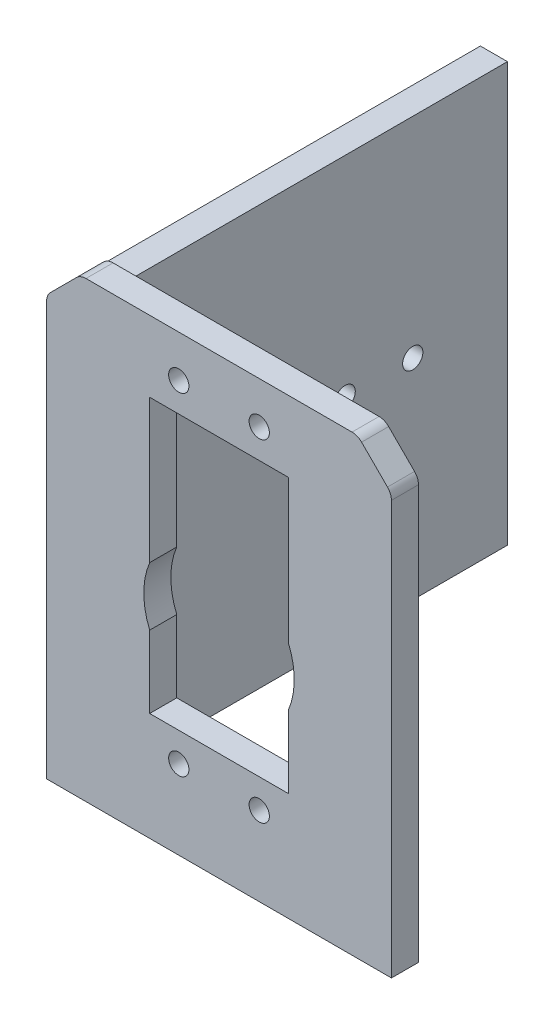
ISO-10303-21;
HEADER;
FILE_DESCRIPTION(('STEP AP214'),'2;1');
FILE_NAME('part.step','',(''),(''),'','','');
FILE_SCHEMA(('AUTOMOTIVE_DESIGN { 1 0 10303 214 1 1 1 1 }'));
ENDSEC;
DATA;
#1=APPLICATION_CONTEXT('core data for automotive mechanical design processes');
#2=APPLICATION_PROTOCOL_DEFINITION('international standard','automotive_design',2000,#1);
#3=PRODUCT_CONTEXT('',#1,'mechanical');
#4=PRODUCT('Part','Part','',(#3));
#5=PRODUCT_RELATED_PRODUCT_CATEGORY('part','',(#4));
#6=PRODUCT_DEFINITION_FORMATION('','',#4);
#7=PRODUCT_DEFINITION_CONTEXT('part definition',#1,'design');
#8=PRODUCT_DEFINITION('design','',#6,#7);
#9=PRODUCT_DEFINITION_SHAPE('','',#8);
#10=(LENGTH_UNIT() NAMED_UNIT(*) SI_UNIT(.MILLI.,.METRE.));
#11=(NAMED_UNIT(*) PLANE_ANGLE_UNIT() SI_UNIT($,.RADIAN.));
#12=(NAMED_UNIT(*) SI_UNIT($,.STERADIAN.) SOLID_ANGLE_UNIT());
#13=UNCERTAINTY_MEASURE_WITH_UNIT(LENGTH_MEASURE(1.E-05),#10,'distance_accuracy_value','');
#14=(GEOMETRIC_REPRESENTATION_CONTEXT(3) GLOBAL_UNCERTAINTY_ASSIGNED_CONTEXT((#13)) GLOBAL_UNIT_ASSIGNED_CONTEXT((#10,
#11,#12)) REPRESENTATION_CONTEXT('',''));
#15=CARTESIAN_POINT('',(0.,0.,0.));
#16=DIRECTION('',(0.,0.,1.));
#17=DIRECTION('',(1.,0.,0.));
#18=AXIS2_PLACEMENT_3D('',#15,#16,#17);
#19=CARTESIAN_POINT('',(2.,61.1715728752538,0.));
#20=DIRECTION('',(0.,0.,1.));
#21=DIRECTION('',(1.,0.,0.));
#22=AXIS2_PLACEMENT_3D('',#19,#20,#21);
#23=PLANE('',#22);
#24=DIRECTION('',(0.,1.,0.));
#25=VECTOR('',#24,1.);
#26=CARTESIAN_POINT('',(0.152240934977426,61.936939739984,0.));
#27=LINE('',#26,#25);
#28=CARTESIAN_POINT('',(0.152240934977426,0.,0.));
#29=VERTEX_POINT('',#28);
#30=CARTESIAN_POINT('',(0.152240934977428,61.936939739984,0.));
#31=VERTEX_POINT('',#30);
#32=EDGE_CURVE('E69',#29,#31,#27,.T.);
#33=ORIENTED_EDGE('',*,*,#32,.F.);
#34=DIRECTION('',(1.,0.,0.));
#35=VECTOR('',#34,1.);
#36=CARTESIAN_POINT('',(0.,0.,0.));
#37=LINE('',#36,#35);
#38=CARTESIAN_POINT('',(0.,0.,0.));
#39=VERTEX_POINT('',#38);
#40=EDGE_CURVE('E385',#39,#29,#37,.T.);
#41=ORIENTED_EDGE('',*,*,#40,.F.);
#42=DIRECTION('',(0.,-1.,0.));
#43=VECTOR('',#42,1.);
#44=CARTESIAN_POINT('',(0.,61.1715728752538,0.));
#45=LINE('',#44,#43);
#46=CARTESIAN_POINT('',(0.,61.1715728752538,0.));
#47=VERTEX_POINT('',#46);
#48=EDGE_CURVE('E382',#47,#39,#45,.T.);
#49=ORIENTED_EDGE('',*,*,#48,.F.);
#50=CARTESIAN_POINT('',(2.,61.1715728752538,0.));
#51=DIRECTION('',(0.,0.,1.));
#52=DIRECTION('',(1.,0.,0.));
#53=AXIS2_PLACEMENT_3D('',#50,#51,#52);
#54=CIRCLE('',#53,2.);
#55=EDGE_CURVE('E344',#31,#47,#54,.T.);
#56=ORIENTED_EDGE('',*,*,#55,.F.);
#57=EDGE_LOOP('',(#33,#41,#49,#56));
#58=FACE_BOUND('',#57,.T.);
#59=ADVANCED_FACE('F43',(#58),#23,.F.);
#60=CARTESIAN_POINT('',(19.55,60.8,0.));
#61=DIRECTION('',(0.,0.,1.));
#62=DIRECTION('',(1.,0.,0.));
#63=AXIS2_PLACEMENT_3D('',#60,#61,#62);
#64=CIRCLE('',#63,1.5);
#65=CARTESIAN_POINT('',(21.05,60.8,0.));
#66=VERTEX_POINT('',#65);
#67=EDGE_CURVE('E223',#66,#66,#64,.T.);
#68=ORIENTED_EDGE('',*,*,#67,.T.);
#69=EDGE_LOOP('',(#68));
#70=FACE_BOUND('',#69,.T.);
#71=CARTESIAN_POINT('',(31.45,60.8,0.));
#72=DIRECTION('',(0.,0.,1.));
#73=DIRECTION('',(1.,0.,0.));
#74=AXIS2_PLACEMENT_3D('',#71,#72,#73);
#75=CIRCLE('',#74,1.5);
#76=CARTESIAN_POINT('',(32.95,60.8,0.));
#77=VERTEX_POINT('',#76);
#78=EDGE_CURVE('E236',#77,#77,#75,.T.);
#79=ORIENTED_EDGE('',*,*,#78,.T.);
#80=EDGE_LOOP('',(#79));
#81=FACE_BOUND('',#80,.T.);
#82=CARTESIAN_POINT('',(31.4499999999995,11.7,0.));
#83=DIRECTION('',(0.,0.,1.));
#84=DIRECTION('',(1.,0.,0.));
#85=AXIS2_PLACEMENT_3D('',#82,#83,#84);
#86=CIRCLE('',#85,1.5);
#87=CARTESIAN_POINT('',(32.9499999999995,11.7,0.));
#88=VERTEX_POINT('',#87);
#89=EDGE_CURVE('E242',#88,#88,#86,.T.);
#90=ORIENTED_EDGE('',*,*,#89,.T.);
#91=EDGE_LOOP('',(#90));
#92=FACE_BOUND('',#91,.T.);
#93=CARTESIAN_POINT('',(19.5499999999995,11.7,0.));
#94=DIRECTION('',(0.,0.,1.));
#95=DIRECTION('',(1.,0.,0.));
#96=AXIS2_PLACEMENT_3D('',#93,#94,#95);
#97=CIRCLE('',#96,1.5);
#98=CARTESIAN_POINT('',(21.0499999999995,11.7,0.));
#99=VERTEX_POINT('',#98);
#100=EDGE_CURVE('E250',#99,#99,#97,.T.);
#101=ORIENTED_EDGE('',*,*,#100,.T.);
#102=EDGE_LOOP('',(#101));
#103=FACE_BOUND('',#102,.T.);
#104=DIRECTION('',(0.,-1.,0.));
#105=VECTOR('',#104,1.);
#106=CARTESIAN_POINT('',(15.25,35.3247109730015,0.));
#107=LINE('',#106,#105);
#108=CARTESIAN_POINT('',(15.25,56.5,0.));
#109=VERTEX_POINT('',#108);
#110=CARTESIAN_POINT('',(15.25,35.3247109730015,0.));
#111=VERTEX_POINT('',#110);
#112=EDGE_CURVE('E258',#109,#111,#107,.T.);
#113=ORIENTED_EDGE('',*,*,#112,.T.);
#114=CARTESIAN_POINT('',(25.5,31.,0.));
#115=DIRECTION('',(0.,0.,1.));
#116=DIRECTION('',(1.,0.,0.));
#117=AXIS2_PLACEMENT_3D('',#114,#115,#116);
#118=CIRCLE('',#117,11.125);
#119=CARTESIAN_POINT('',(15.25,26.6752890269985,0.));
#120=VERTEX_POINT('',#119);
#121=EDGE_CURVE('E292',#111,#120,#118,.T.);
#122=ORIENTED_EDGE('',*,*,#121,.T.);
#123=DIRECTION('',(0.,-1.,0.));
#124=VECTOR('',#123,1.);
#125=CARTESIAN_POINT('',(15.25,16.,0.));
#126=LINE('',#125,#124);
#127=CARTESIAN_POINT('',(15.25,16.,0.));
#128=VERTEX_POINT('',#127);
#129=EDGE_CURVE('E296',#120,#128,#126,.T.);
#130=ORIENTED_EDGE('',*,*,#129,.T.);
#131=DIRECTION('',(1.,0.,0.));
#132=VECTOR('',#131,1.);
#133=CARTESIAN_POINT('',(35.75,16.,0.));
#134=LINE('',#133,#132);
#135=CARTESIAN_POINT('',(35.75,16.,0.));
#136=VERTEX_POINT('',#135);
#137=EDGE_CURVE('E300',#128,#136,#134,.T.);
#138=ORIENTED_EDGE('',*,*,#137,.T.);
#139=DIRECTION('',(0.,1.,0.));
#140=VECTOR('',#139,1.);
#141=CARTESIAN_POINT('',(35.75,26.6752890269984,0.));
#142=LINE('',#141,#140);
#143=CARTESIAN_POINT('',(35.75,26.6752890269984,0.));
#144=VERTEX_POINT('',#143);
#145=EDGE_CURVE('E304',#136,#144,#142,.T.);
#146=ORIENTED_EDGE('',*,*,#145,.T.);
#147=CARTESIAN_POINT('',(25.5,31.,0.));
#148=DIRECTION('',(0.,0.,1.));
#149=DIRECTION('',(1.,0.,0.));
#150=AXIS2_PLACEMENT_3D('',#147,#148,#149);
#151=CIRCLE('',#150,11.125);
#152=CARTESIAN_POINT('',(35.75,35.3247109730016,0.));
#153=VERTEX_POINT('',#152);
#154=EDGE_CURVE('E308',#144,#153,#151,.T.);
#155=ORIENTED_EDGE('',*,*,#154,.T.);
#156=DIRECTION('',(0.,1.,0.));
#157=VECTOR('',#156,1.);
#158=CARTESIAN_POINT('',(35.75,56.5,0.));
#159=LINE('',#158,#157);
#160=CARTESIAN_POINT('',(35.75,56.5,0.));
#161=VERTEX_POINT('',#160);
#162=EDGE_CURVE('E312',#153,#161,#159,.T.);
#163=ORIENTED_EDGE('',*,*,#162,.T.);
#164=DIRECTION('',(-1.,0.,0.));
#165=VECTOR('',#164,1.);
#166=CARTESIAN_POINT('',(15.25,56.5,0.));
#167=LINE('',#166,#165);
#168=EDGE_CURVE('E266',#161,#109,#167,.T.);
#169=ORIENTED_EDGE('',*,*,#168,.T.);
#170=EDGE_LOOP('',(#113,#122,#130,#138,#146,#155,#163,#169));
#171=FACE_BOUND('',#170,.T.);
#172=DIRECTION('',(0.,-1.,0.));
#173=VECTOR('',#172,1.);
#174=CARTESIAN_POINT('',(4.15224093497743,61.936939739984,0.));
#175=LINE('',#174,#173);
#176=CARTESIAN_POINT('',(4.15224093497743,61.936939739984,0.));
#177=VERTEX_POINT('',#176);
#178=CARTESIAN_POINT('',(4.15224093497742,0.,0.));
#179=VERTEX_POINT('',#178);
#180=EDGE_CURVE('E219',#177,#179,#175,.T.);
#181=ORIENTED_EDGE('',*,*,#180,.F.);
#182=DIRECTION('',(1.,0.,0.));
#183=VECTOR('',#182,1.);
#184=CARTESIAN_POINT('',(0.152240934977426,61.936939739984,0.));
#185=LINE('',#184,#183);
#186=EDGE_CURVE('E466',#31,#177,#185,.T.);
#187=ORIENTED_EDGE('',*,*,#186,.F.);
#188=CARTESIAN_POINT('',(0.585786437626903,62.5857864376269,0.));
#189=VERTEX_POINT('',#188);
#190=EDGE_CURVE('E378',#189,#31,#54,.T.);
#191=ORIENTED_EDGE('',*,*,#190,.F.);
#192=DIRECTION('',(-0.707106781186546,-0.707106781186549,0.));
#193=VECTOR('',#192,1.);
#194=CARTESIAN_POINT('',(4.41421356237308,66.4142135623731,0.));
#195=LINE('',#194,#193);
#196=CARTESIAN_POINT('',(4.41421356237308,66.4142135623731,0.));
#197=VERTEX_POINT('',#196);
#198=EDGE_CURVE('E350',#197,#189,#195,.T.);
#199=ORIENTED_EDGE('',*,*,#198,.F.);
#200=CARTESIAN_POINT('',(5.82842712474618,65.,0.));
#201=DIRECTION('',(0.,0.,1.));
#202=DIRECTION('',(1.,0.,0.));
#203=AXIS2_PLACEMENT_3D('',#200,#201,#202);
#204=CIRCLE('',#203,2.);
#205=CARTESIAN_POINT('',(5.82842712474618,67.,0.));
#206=VERTEX_POINT('',#205);
#207=EDGE_CURVE('E403',#206,#197,#204,.T.);
#208=ORIENTED_EDGE('',*,*,#207,.F.);
#209=DIRECTION('',(-1.,0.,0.));
#210=VECTOR('',#209,1.);
#211=CARTESIAN_POINT('',(45.1715728752538,67.,0.));
#212=LINE('',#211,#210);
#213=CARTESIAN_POINT('',(45.1715728752538,67.,0.));
#214=VERTEX_POINT('',#213);
#215=EDGE_CURVE('E400',#214,#206,#212,.T.);
#216=ORIENTED_EDGE('',*,*,#215,.F.);
#217=CARTESIAN_POINT('',(45.1715728752538,65.,0.));
#218=DIRECTION('',(0.,0.,1.));
#219=DIRECTION('',(1.,0.,0.));
#220=AXIS2_PLACEMENT_3D('',#217,#218,#219);
#221=CIRCLE('',#220,2.);
#222=CARTESIAN_POINT('',(46.5857864376269,66.4142135623731,0.));
#223=VERTEX_POINT('',#222);
#224=EDGE_CURVE('E397',#223,#214,#221,.T.);
#225=ORIENTED_EDGE('',*,*,#224,.F.);
#226=DIRECTION('',(-0.707106781186549,0.707106781186546,0.));
#227=VECTOR('',#226,1.);
#228=CARTESIAN_POINT('',(50.4142135623731,62.5857864376269,0.));
#229=LINE('',#228,#227);
#230=CARTESIAN_POINT('',(50.4142135623731,62.5857864376269,0.));
#231=VERTEX_POINT('',#230);
#232=EDGE_CURVE('E394',#231,#223,#229,.T.);
#233=ORIENTED_EDGE('',*,*,#232,.F.);
#234=CARTESIAN_POINT('',(49.,61.1715728752538,0.));
#235=DIRECTION('',(0.,0.,1.));
#236=DIRECTION('',(1.,0.,0.));
#237=AXIS2_PLACEMENT_3D('',#234,#235,#236);
#238=CIRCLE('',#237,2.);
#239=CARTESIAN_POINT('',(51.,61.1715728752538,0.));
#240=VERTEX_POINT('',#239);
#241=EDGE_CURVE('E391',#240,#231,#238,.T.);
#242=ORIENTED_EDGE('',*,*,#241,.F.);
#243=DIRECTION('',(0.,1.,0.));
#244=VECTOR('',#243,1.);
#245=CARTESIAN_POINT('',(51.,0.,0.));
#246=LINE('',#245,#244);
#247=CARTESIAN_POINT('',(51.,0.,0.));
#248=VERTEX_POINT('',#247);
#249=EDGE_CURVE('E388',#248,#240,#246,.T.);
#250=ORIENTED_EDGE('',*,*,#249,.F.);
#251=EDGE_CURVE('E61',#179,#248,#37,.T.);
#252=ORIENTED_EDGE('',*,*,#251,.F.);
#253=EDGE_LOOP('',(#181,#187,#191,#199,#208,#216,#225,#233,#242,#250,#252));
#254=FACE_BOUND('',#253,.T.);
#255=ADVANCED_FACE('F480',(#70,#81,#92,#103,#171,#254),#23,.F.);
#256=CARTESIAN_POINT('',(2.,61.1715728752538,4.));
#257=DIRECTION('',(0.,0.,1.));
#258=DIRECTION('',(1.,0.,0.));
#259=AXIS2_PLACEMENT_3D('',#256,#257,#258);
#260=PLANE('',#259);
#261=CARTESIAN_POINT('',(31.45,60.8,4.));
#262=DIRECTION('',(0.,0.,1.));
#263=DIRECTION('',(1.,0.,0.));
#264=AXIS2_PLACEMENT_3D('',#261,#262,#263);
#265=CIRCLE('',#264,1.5);
#266=CARTESIAN_POINT('',(32.95,60.8,4.));
#267=VERTEX_POINT('',#266);
#268=EDGE_CURVE('E238',#267,#267,#265,.T.);
#269=ORIENTED_EDGE('',*,*,#268,.F.);
#270=EDGE_LOOP('',(#269));
#271=FACE_BOUND('',#270,.T.);
#272=CARTESIAN_POINT('',(19.5499999999995,11.7,4.));
#273=DIRECTION('',(0.,0.,1.));
#274=DIRECTION('',(1.,0.,0.));
#275=AXIS2_PLACEMENT_3D('',#272,#273,#274);
#276=CIRCLE('',#275,1.5);
#277=CARTESIAN_POINT('',(21.0499999999995,11.7,4.));
#278=VERTEX_POINT('',#277);
#279=EDGE_CURVE('E254',#278,#278,#276,.T.);
#280=ORIENTED_EDGE('',*,*,#279,.F.);
#281=EDGE_LOOP('',(#280));
#282=FACE_BOUND('',#281,.T.);
#283=CARTESIAN_POINT('',(2.,61.1715728752538,4.));
#284=DIRECTION('',(0.,0.,1.));
#285=DIRECTION('',(1.,0.,0.));
#286=AXIS2_PLACEMENT_3D('',#283,#284,#285);
#287=CIRCLE('',#286,2.);
#288=CARTESIAN_POINT('',(0.585786437626903,62.5857864376269,4.));
#289=VERTEX_POINT('',#288);
#290=CARTESIAN_POINT('',(0.,61.1715728752538,4.));
#291=VERTEX_POINT('',#290);
#292=EDGE_CURVE('E345',#289,#291,#287,.T.);
#293=ORIENTED_EDGE('',*,*,#292,.T.);
#294=DIRECTION('',(0.,-1.,0.));
#295=VECTOR('',#294,1.);
#296=CARTESIAN_POINT('',(0.,61.1715728752538,4.));
#297=LINE('',#296,#295);
#298=CARTESIAN_POINT('',(0.,0.,4.));
#299=VERTEX_POINT('',#298);
#300=EDGE_CURVE('E349',#291,#299,#297,.T.);
#301=ORIENTED_EDGE('',*,*,#300,.T.);
#302=DIRECTION('',(1.,0.,0.));
#303=VECTOR('',#302,1.);
#304=CARTESIAN_POINT('',(0.,0.,4.));
#305=LINE('',#304,#303);
#306=CARTESIAN_POINT('',(51.,0.,4.));
#307=VERTEX_POINT('',#306);
#308=EDGE_CURVE('E353',#299,#307,#305,.T.);
#309=ORIENTED_EDGE('',*,*,#308,.T.);
#310=DIRECTION('',(0.,1.,0.));
#311=VECTOR('',#310,1.);
#312=CARTESIAN_POINT('',(51.,0.,4.));
#313=LINE('',#312,#311);
#314=CARTESIAN_POINT('',(51.,61.1715728752538,4.));
#315=VERTEX_POINT('',#314);
#316=EDGE_CURVE('E356',#307,#315,#313,.T.);
#317=ORIENTED_EDGE('',*,*,#316,.T.);
#318=CARTESIAN_POINT('',(49.,61.1715728752538,4.));
#319=DIRECTION('',(0.,0.,1.));
#320=DIRECTION('',(1.,0.,0.));
#321=AXIS2_PLACEMENT_3D('',#318,#319,#320);
#322=CIRCLE('',#321,2.);
#323=CARTESIAN_POINT('',(50.4142135623731,62.5857864376269,4.));
#324=VERTEX_POINT('',#323);
#325=EDGE_CURVE('E359',#315,#324,#322,.T.);
#326=ORIENTED_EDGE('',*,*,#325,.T.);
#327=DIRECTION('',(-0.707106781186549,0.707106781186546,0.));
#328=VECTOR('',#327,1.);
#329=CARTESIAN_POINT('',(50.4142135623731,62.5857864376269,4.));
#330=LINE('',#329,#328);
#331=CARTESIAN_POINT('',(46.5857864376269,66.4142135623731,4.));
#332=VERTEX_POINT('',#331);
#333=EDGE_CURVE('E362',#324,#332,#330,.T.);
#334=ORIENTED_EDGE('',*,*,#333,.T.);
#335=CARTESIAN_POINT('',(45.1715728752538,65.,4.));
#336=DIRECTION('',(0.,0.,1.));
#337=DIRECTION('',(1.,0.,0.));
#338=AXIS2_PLACEMENT_3D('',#335,#336,#337);
#339=CIRCLE('',#338,2.);
#340=CARTESIAN_POINT('',(45.1715728752538,67.,4.));
#341=VERTEX_POINT('',#340);
#342=EDGE_CURVE('E365',#332,#341,#339,.T.);
#343=ORIENTED_EDGE('',*,*,#342,.T.);
#344=DIRECTION('',(-1.,0.,0.));
#345=VECTOR('',#344,1.);
#346=CARTESIAN_POINT('',(45.1715728752538,67.,4.));
#347=LINE('',#346,#345);
#348=CARTESIAN_POINT('',(5.82842712474618,67.,4.));
#349=VERTEX_POINT('',#348);
#350=EDGE_CURVE('E368',#341,#349,#347,.T.);
#351=ORIENTED_EDGE('',*,*,#350,.T.);
#352=CARTESIAN_POINT('',(5.82842712474618,65.,4.));
#353=DIRECTION('',(0.,0.,1.));
#354=DIRECTION('',(1.,0.,0.));
#355=AXIS2_PLACEMENT_3D('',#352,#353,#354);
#356=CIRCLE('',#355,2.);
#357=CARTESIAN_POINT('',(4.41421356237308,66.4142135623731,4.));
#358=VERTEX_POINT('',#357);
#359=EDGE_CURVE('E371',#349,#358,#356,.T.);
#360=ORIENTED_EDGE('',*,*,#359,.T.);
#361=DIRECTION('',(-0.707106781186546,-0.707106781186549,0.));
#362=VECTOR('',#361,1.);
#363=CARTESIAN_POINT('',(4.41421356237308,66.4142135623731,4.));
#364=LINE('',#363,#362);
#365=EDGE_CURVE('E374',#358,#289,#364,.T.);
#366=ORIENTED_EDGE('',*,*,#365,.T.);
#367=EDGE_LOOP('',(#293,#301,#309,#317,#326,#334,#343,#351,#360,#366));
#368=FACE_BOUND('',#367,.T.);
#369=CARTESIAN_POINT('',(25.5,31.,4.));
#370=DIRECTION('',(0.,0.,1.));
#371=DIRECTION('',(1.,0.,0.));
#372=AXIS2_PLACEMENT_3D('',#369,#370,#371);
#373=CIRCLE('',#372,11.125);
#374=CARTESIAN_POINT('',(15.25,35.3247109730015,4.));
#375=VERTEX_POINT('',#374);
#376=CARTESIAN_POINT('',(15.25,26.6752890269985,4.));
#377=VERTEX_POINT('',#376);
#378=EDGE_CURVE('E265',#375,#377,#373,.T.);
#379=ORIENTED_EDGE('',*,*,#378,.F.);
#380=DIRECTION('',(0.,-1.,0.));
#381=VECTOR('',#380,1.);
#382=CARTESIAN_POINT('',(15.25,35.3247109730015,4.));
#383=LINE('',#382,#381);
#384=CARTESIAN_POINT('',(15.25,56.5,4.));
#385=VERTEX_POINT('',#384);
#386=EDGE_CURVE('E262',#385,#375,#383,.T.);
#387=ORIENTED_EDGE('',*,*,#386,.F.);
#388=DIRECTION('',(-1.,0.,0.));
#389=VECTOR('',#388,1.);
#390=CARTESIAN_POINT('',(15.25,56.5,4.));
#391=LINE('',#390,#389);
#392=CARTESIAN_POINT('',(35.75,56.5,4.));
#393=VERTEX_POINT('',#392);
#394=EDGE_CURVE('E285',#393,#385,#391,.T.);
#395=ORIENTED_EDGE('',*,*,#394,.F.);
#396=DIRECTION('',(0.,1.,0.));
#397=VECTOR('',#396,1.);
#398=CARTESIAN_POINT('',(35.75,56.5,4.));
#399=LINE('',#398,#397);
#400=CARTESIAN_POINT('',(35.75,35.3247109730016,4.));
#401=VERTEX_POINT('',#400);
#402=EDGE_CURVE('E281',#401,#393,#399,.T.);
#403=ORIENTED_EDGE('',*,*,#402,.F.);
#404=CARTESIAN_POINT('',(25.5,31.,4.));
#405=DIRECTION('',(0.,0.,1.));
#406=DIRECTION('',(1.,0.,0.));
#407=AXIS2_PLACEMENT_3D('',#404,#405,#406);
#408=CIRCLE('',#407,11.125);
#409=CARTESIAN_POINT('',(35.75,26.6752890269984,4.));
#410=VERTEX_POINT('',#409);
#411=EDGE_CURVE('E278',#410,#401,#408,.T.);
#412=ORIENTED_EDGE('',*,*,#411,.F.);
#413=DIRECTION('',(0.,1.,0.));
#414=VECTOR('',#413,1.);
#415=CARTESIAN_POINT('',(35.75,26.6752890269984,4.));
#416=LINE('',#415,#414);
#417=CARTESIAN_POINT('',(35.75,16.,4.));
#418=VERTEX_POINT('',#417);
#419=EDGE_CURVE('E275',#418,#410,#416,.T.);
#420=ORIENTED_EDGE('',*,*,#419,.F.);
#421=DIRECTION('',(1.,0.,0.));
#422=VECTOR('',#421,1.);
#423=CARTESIAN_POINT('',(35.75,16.,4.));
#424=LINE('',#423,#422);
#425=CARTESIAN_POINT('',(15.25,16.,4.));
#426=VERTEX_POINT('',#425);
#427=EDGE_CURVE('E272',#426,#418,#424,.T.);
#428=ORIENTED_EDGE('',*,*,#427,.F.);
#429=DIRECTION('',(0.,-1.,0.));
#430=VECTOR('',#429,1.);
#431=CARTESIAN_POINT('',(15.25,16.,4.));
#432=LINE('',#431,#430);
#433=EDGE_CURVE('E269',#377,#426,#432,.T.);
#434=ORIENTED_EDGE('',*,*,#433,.F.);
#435=EDGE_LOOP('',(#379,#387,#395,#403,#412,#420,#428,#434));
#436=FACE_BOUND('',#435,.T.);
#437=CARTESIAN_POINT('',(31.4499999999995,11.7,4.));
#438=DIRECTION('',(0.,0.,1.));
#439=DIRECTION('',(1.,0.,0.));
#440=AXIS2_PLACEMENT_3D('',#437,#438,#439);
#441=CIRCLE('',#440,1.5);
#442=CARTESIAN_POINT('',(32.9499999999995,11.7,4.));
#443=VERTEX_POINT('',#442);
#444=EDGE_CURVE('E246',#443,#443,#441,.T.);
#445=ORIENTED_EDGE('',*,*,#444,.F.);
#446=EDGE_LOOP('',(#445));
#447=FACE_BOUND('',#446,.T.);
#448=CARTESIAN_POINT('',(19.55,60.8,4.));
#449=DIRECTION('',(0.,0.,1.));
#450=DIRECTION('',(1.,0.,0.));
#451=AXIS2_PLACEMENT_3D('',#448,#449,#450);
#452=CIRCLE('',#451,1.5);
#453=CARTESIAN_POINT('',(21.05,60.8,4.));
#454=VERTEX_POINT('',#453);
#455=EDGE_CURVE('E228',#454,#454,#452,.T.);
#456=ORIENTED_EDGE('',*,*,#455,.F.);
#457=EDGE_LOOP('',(#456));
#458=FACE_BOUND('',#457,.T.);
#459=ADVANCED_FACE('F524',(#271,#282,#368,#436,#447,#458),#260,.T.);
#460=CARTESIAN_POINT('',(2.,61.1715728752538,4.));
#461=DIRECTION('',(0.,0.,-1.));
#462=DIRECTION('',(-1.,0.,0.));
#463=AXIS2_PLACEMENT_3D('',#460,#461,#462);
#464=CYLINDRICAL_SURFACE('',#463,2.);
#465=ORIENTED_EDGE('',*,*,#190,.T.);
#466=ORIENTED_EDGE('',*,*,#55,.T.);
#467=DIRECTION('',(0.,0.,-1.));
#468=VECTOR('',#467,1.);
#469=CARTESIAN_POINT('',(0.,61.1715728752538,4.));
#470=LINE('',#469,#468);
#471=EDGE_CURVE('E11',#291,#47,#470,.T.);
#472=ORIENTED_EDGE('',*,*,#471,.F.);
#473=ORIENTED_EDGE('',*,*,#292,.F.);
#474=DIRECTION('',(0.,0.,-1.));
#475=VECTOR('',#474,1.);
#476=CARTESIAN_POINT('',(0.585786437626903,62.5857864376269,4.));
#477=LINE('',#476,#475);
#478=EDGE_CURVE('E377',#289,#189,#477,.T.);
#479=ORIENTED_EDGE('',*,*,#478,.T.);
#480=EDGE_LOOP('',(#465,#466,#472,#473,#479));
#481=FACE_BOUND('',#480,.T.);
#482=ADVANCED_FACE('F45',(#481),#464,.T.);
#483=CARTESIAN_POINT('',(0.,61.1715728752538,4.));
#484=DIRECTION('',(1.,0.,0.));
#485=DIRECTION('',(0.,0.,-1.));
#486=AXIS2_PLACEMENT_3D('',#483,#484,#485);
#487=PLANE('',#486);
#488=ORIENTED_EDGE('',*,*,#48,.T.);
#489=DIRECTION('',(0.,0.,-1.));
#490=VECTOR('',#489,1.);
#491=CARTESIAN_POINT('',(0.,0.,4.));
#492=LINE('',#491,#490);
#493=EDGE_CURVE('E53',#299,#39,#492,.T.);
#494=ORIENTED_EDGE('',*,*,#493,.F.);
#495=ORIENTED_EDGE('',*,*,#300,.F.);
#496=ORIENTED_EDGE('',*,*,#471,.T.);
#497=EDGE_LOOP('',(#488,#494,#495,#496));
#498=FACE_BOUND('',#497,.T.);
#499=ADVANCED_FACE('F527',(#498),#487,.F.);
#500=CARTESIAN_POINT('',(0.,0.,4.));
#501=DIRECTION('',(0.,1.,0.));
#502=DIRECTION('',(0.,0.,1.));
#503=AXIS2_PLACEMENT_3D('',#500,#501,#502);
#504=PLANE('',#503);
#505=ORIENTED_EDGE('',*,*,#40,.T.);
#506=DIRECTION('',(0.,0.,1.));
#507=VECTOR('',#506,1.);
#508=CARTESIAN_POINT('',(0.152240934977426,0.,-60.));
#509=LINE('',#508,#507);
#510=CARTESIAN_POINT('',(0.152240934977426,0.,-60.));
#511=VERTEX_POINT('',#510);
#512=EDGE_CURVE('E463',#511,#29,#509,.T.);
#513=ORIENTED_EDGE('',*,*,#512,.F.);
#514=DIRECTION('',(-1.,0.,0.));
#515=VECTOR('',#514,1.);
#516=CARTESIAN_POINT('',(0.152240934977426,0.,-60.));
#517=LINE('',#516,#515);
#518=CARTESIAN_POINT('',(4.15224093497742,0.,-60.));
#519=VERTEX_POINT('',#518);
#520=EDGE_CURVE('E214',#519,#511,#517,.T.);
#521=ORIENTED_EDGE('',*,*,#520,.F.);
#522=DIRECTION('',(0.,0.,1.));
#523=VECTOR('',#522,1.);
#524=CARTESIAN_POINT('',(4.15224093497742,0.,-60.));
#525=LINE('',#524,#523);
#526=EDGE_CURVE('E230',#519,#179,#525,.T.);
#527=ORIENTED_EDGE('',*,*,#526,.T.);
#528=ORIENTED_EDGE('',*,*,#251,.T.);
#529=DIRECTION('',(0.,0.,-1.));
#530=VECTOR('',#529,1.);
#531=CARTESIAN_POINT('',(51.,0.,4.));
#532=LINE('',#531,#530);
#533=EDGE_CURVE('E435',#307,#248,#532,.T.);
#534=ORIENTED_EDGE('',*,*,#533,.F.);
#535=ORIENTED_EDGE('',*,*,#308,.F.);
#536=ORIENTED_EDGE('',*,*,#493,.T.);
#537=EDGE_LOOP('',(#505,#513,#521,#527,#528,#534,#535,#536));
#538=FACE_BOUND('',#537,.T.);
#539=ADVANCED_FACE('F476',(#538),#504,.F.);
#540=CARTESIAN_POINT('',(51.,0.,4.));
#541=DIRECTION('',(-1.,0.,0.));
#542=DIRECTION('',(0.,0.,1.));
#543=AXIS2_PLACEMENT_3D('',#540,#541,#542);
#544=PLANE('',#543);
#545=ORIENTED_EDGE('',*,*,#249,.T.);
#546=DIRECTION('',(0.,0.,-1.));
#547=VECTOR('',#546,1.);
#548=CARTESIAN_POINT('',(51.,61.1715728752538,4.));
#549=LINE('',#548,#547);
#550=EDGE_CURVE('E431',#315,#240,#549,.T.);
#551=ORIENTED_EDGE('',*,*,#550,.F.);
#552=ORIENTED_EDGE('',*,*,#316,.F.);
#553=ORIENTED_EDGE('',*,*,#533,.T.);
#554=EDGE_LOOP('',(#545,#551,#552,#553));
#555=FACE_BOUND('',#554,.T.);
#556=ADVANCED_FACE('F520',(#555),#544,.F.);
#557=CARTESIAN_POINT('',(49.,61.1715728752538,4.));
#558=DIRECTION('',(0.,0.,-1.));
#559=DIRECTION('',(-1.,0.,0.));
#560=AXIS2_PLACEMENT_3D('',#557,#558,#559);
#561=CYLINDRICAL_SURFACE('',#560,2.);
#562=ORIENTED_EDGE('',*,*,#241,.T.);
#563=DIRECTION('',(0.,0.,-1.));
#564=VECTOR('',#563,1.);
#565=CARTESIAN_POINT('',(50.4142135623731,62.5857864376269,4.));
#566=LINE('',#565,#564);
#567=EDGE_CURVE('E427',#324,#231,#566,.T.);
#568=ORIENTED_EDGE('',*,*,#567,.F.);
#569=ORIENTED_EDGE('',*,*,#325,.F.);
#570=ORIENTED_EDGE('',*,*,#550,.T.);
#571=EDGE_LOOP('',(#562,#568,#569,#570));
#572=FACE_BOUND('',#571,.T.);
#573=ADVANCED_FACE('F516',(#572),#561,.T.);
#574=CARTESIAN_POINT('',(50.4142135623731,62.5857864376269,4.));
#575=DIRECTION('',(-0.707106781186546,-0.707106781186549,0.));
#576=DIRECTION('',(0.707106781186549,-0.707106781186546,0.));
#577=AXIS2_PLACEMENT_3D('',#574,#575,#576);
#578=PLANE('',#577);
#579=ORIENTED_EDGE('',*,*,#232,.T.);
#580=DIRECTION('',(0.,0.,-1.));
#581=VECTOR('',#580,1.);
#582=CARTESIAN_POINT('',(46.5857864376269,66.4142135623731,4.));
#583=LINE('',#582,#581);
#584=EDGE_CURVE('E423',#332,#223,#583,.T.);
#585=ORIENTED_EDGE('',*,*,#584,.F.);
#586=ORIENTED_EDGE('',*,*,#333,.F.);
#587=ORIENTED_EDGE('',*,*,#567,.T.);
#588=EDGE_LOOP('',(#579,#585,#586,#587));
#589=FACE_BOUND('',#588,.T.);
#590=ADVANCED_FACE('F511',(#589),#578,.F.);
#591=CARTESIAN_POINT('',(45.1715728752538,65.,4.));
#592=DIRECTION('',(0.,0.,-1.));
#593=DIRECTION('',(-1.,0.,0.));
#594=AXIS2_PLACEMENT_3D('',#591,#592,#593);
#595=CYLINDRICAL_SURFACE('',#594,2.);
#596=ORIENTED_EDGE('',*,*,#224,.T.);
#597=DIRECTION('',(0.,0.,-1.));
#598=VECTOR('',#597,1.);
#599=CARTESIAN_POINT('',(45.1715728752538,67.,4.));
#600=LINE('',#599,#598);
#601=EDGE_CURVE('E419',#341,#214,#600,.T.);
#602=ORIENTED_EDGE('',*,*,#601,.F.);
#603=ORIENTED_EDGE('',*,*,#342,.F.);
#604=ORIENTED_EDGE('',*,*,#584,.T.);
#605=EDGE_LOOP('',(#596,#602,#603,#604));
#606=FACE_BOUND('',#605,.T.);
#607=ADVANCED_FACE('F506',(#606),#595,.T.);
#608=CARTESIAN_POINT('',(45.1715728752538,67.,4.));
#609=DIRECTION('',(0.,-1.,0.));
#610=DIRECTION('',(0.,0.,-1.));
#611=AXIS2_PLACEMENT_3D('',#608,#609,#610);
#612=PLANE('',#611);
#613=ORIENTED_EDGE('',*,*,#215,.T.);
#614=DIRECTION('',(0.,0.,-1.));
#615=VECTOR('',#614,1.);
#616=CARTESIAN_POINT('',(5.82842712474618,67.,4.));
#617=LINE('',#616,#615);
#618=EDGE_CURVE('E415',#349,#206,#617,.T.);
#619=ORIENTED_EDGE('',*,*,#618,.F.);
#620=ORIENTED_EDGE('',*,*,#350,.F.);
#621=ORIENTED_EDGE('',*,*,#601,.T.);
#622=EDGE_LOOP('',(#613,#619,#620,#621));
#623=FACE_BOUND('',#622,.T.);
#624=ADVANCED_FACE('F502',(#623),#612,.F.);
#625=CARTESIAN_POINT('',(5.82842712474618,65.,4.));
#626=DIRECTION('',(0.,0.,-1.));
#627=DIRECTION('',(-1.,0.,0.));
#628=AXIS2_PLACEMENT_3D('',#625,#626,#627);
#629=CYLINDRICAL_SURFACE('',#628,2.);
#630=ORIENTED_EDGE('',*,*,#207,.T.);
#631=DIRECTION('',(0.,0.,-1.));
#632=VECTOR('',#631,1.);
#633=CARTESIAN_POINT('',(4.41421356237308,66.4142135623731,4.));
#634=LINE('',#633,#632);
#635=EDGE_CURVE('E411',#358,#197,#634,.T.);
#636=ORIENTED_EDGE('',*,*,#635,.F.);
#637=ORIENTED_EDGE('',*,*,#359,.F.);
#638=ORIENTED_EDGE('',*,*,#618,.T.);
#639=EDGE_LOOP('',(#630,#636,#637,#638));
#640=FACE_BOUND('',#639,.T.);
#641=ADVANCED_FACE('F497',(#640),#629,.T.);
#642=CARTESIAN_POINT('',(4.41421356237308,66.4142135623731,4.));
#643=DIRECTION('',(0.707106781186549,-0.707106781186546,0.));
#644=DIRECTION('',(0.707106781186546,0.707106781186549,0.));
#645=AXIS2_PLACEMENT_3D('',#642,#643,#644);
#646=PLANE('',#645);
#647=ORIENTED_EDGE('',*,*,#198,.T.);
#648=ORIENTED_EDGE('',*,*,#478,.F.);
#649=ORIENTED_EDGE('',*,*,#365,.F.);
#650=ORIENTED_EDGE('',*,*,#635,.T.);
#651=EDGE_LOOP('',(#647,#648,#649,#650));
#652=FACE_BOUND('',#651,.T.);
#653=ADVANCED_FACE('F491',(#652),#646,.F.);
#654=CARTESIAN_POINT('',(15.25,35.3247109730015,4.));
#655=DIRECTION('',(1.,0.,0.));
#656=DIRECTION('',(0.,1.,0.));
#657=AXIS2_PLACEMENT_3D('',#654,#655,#656);
#658=PLANE('',#657);
#659=ORIENTED_EDGE('',*,*,#112,.F.);
#660=DIRECTION('',(0.,0.,-1.));
#661=VECTOR('',#660,1.);
#662=CARTESIAN_POINT('',(15.25,56.5,4.));
#663=LINE('',#662,#661);
#664=EDGE_CURVE('E288',#385,#109,#663,.T.);
#665=ORIENTED_EDGE('',*,*,#664,.F.);
#666=ORIENTED_EDGE('',*,*,#386,.T.);
#667=DIRECTION('',(0.,0.,-1.));
#668=VECTOR('',#667,1.);
#669=CARTESIAN_POINT('',(15.25,35.3247109730015,4.));
#670=LINE('',#669,#668);
#671=EDGE_CURVE('E340',#375,#111,#670,.T.);
#672=ORIENTED_EDGE('',*,*,#671,.T.);
#673=EDGE_LOOP('',(#659,#665,#666,#672));
#674=FACE_BOUND('',#673,.T.);
#675=ADVANCED_FACE('F545',(#674),#658,.T.);
#676=CARTESIAN_POINT('',(25.5,31.,4.));
#677=DIRECTION('',(0.,0.,-1.));
#678=DIRECTION('',(-1.,0.,0.));
#679=AXIS2_PLACEMENT_3D('',#676,#677,#678);
#680=CYLINDRICAL_SURFACE('',#679,11.125);
#681=ORIENTED_EDGE('',*,*,#121,.F.);
#682=ORIENTED_EDGE('',*,*,#671,.F.);
#683=ORIENTED_EDGE('',*,*,#378,.T.);
#684=DIRECTION('',(0.,0.,-1.));
#685=VECTOR('',#684,1.);
#686=CARTESIAN_POINT('',(15.25,26.6752890269985,4.));
#687=LINE('',#686,#685);
#688=EDGE_CURVE('E337',#377,#120,#687,.T.);
#689=ORIENTED_EDGE('',*,*,#688,.T.);
#690=EDGE_LOOP('',(#681,#682,#683,#689));
#691=FACE_BOUND('',#690,.T.);
#692=ADVANCED_FACE('F591',(#691),#680,.F.);
#693=CARTESIAN_POINT('',(15.25,16.,4.));
#694=DIRECTION('',(1.,0.,0.));
#695=DIRECTION('',(0.,1.,0.));
#696=AXIS2_PLACEMENT_3D('',#693,#694,#695);
#697=PLANE('',#696);
#698=ORIENTED_EDGE('',*,*,#129,.F.);
#699=ORIENTED_EDGE('',*,*,#688,.F.);
#700=ORIENTED_EDGE('',*,*,#433,.T.);
#701=DIRECTION('',(0.,0.,-1.));
#702=VECTOR('',#701,1.);
#703=CARTESIAN_POINT('',(15.25,16.,4.));
#704=LINE('',#703,#702);
#705=EDGE_CURVE('E334',#426,#128,#704,.T.);
#706=ORIENTED_EDGE('',*,*,#705,.T.);
#707=EDGE_LOOP('',(#698,#699,#700,#706));
#708=FACE_BOUND('',#707,.T.);
#709=ADVANCED_FACE('F598',(#708),#697,.T.);
#710=CARTESIAN_POINT('',(35.75,16.,4.));
#711=DIRECTION('',(0.,1.,0.));
#712=DIRECTION('',(-1.,0.,0.));
#713=AXIS2_PLACEMENT_3D('',#710,#711,#712);
#714=PLANE('',#713);
#715=ORIENTED_EDGE('',*,*,#137,.F.);
#716=ORIENTED_EDGE('',*,*,#705,.F.);
#717=ORIENTED_EDGE('',*,*,#427,.T.);
#718=DIRECTION('',(0.,0.,-1.));
#719=VECTOR('',#718,1.);
#720=CARTESIAN_POINT('',(35.75,16.,4.));
#721=LINE('',#720,#719);
#722=EDGE_CURVE('E331',#418,#136,#721,.T.);
#723=ORIENTED_EDGE('',*,*,#722,.T.);
#724=EDGE_LOOP('',(#715,#716,#717,#723));
#725=FACE_BOUND('',#724,.T.);
#726=ADVANCED_FACE('F606',(#725),#714,.T.);
#727=CARTESIAN_POINT('',(35.75,26.6752890269984,4.));
#728=DIRECTION('',(-1.,0.,0.));
#729=DIRECTION('',(0.,0.,1.));
#730=AXIS2_PLACEMENT_3D('',#727,#728,#729);
#731=PLANE('',#730);
#732=ORIENTED_EDGE('',*,*,#145,.F.);
#733=ORIENTED_EDGE('',*,*,#722,.F.);
#734=ORIENTED_EDGE('',*,*,#419,.T.);
#735=DIRECTION('',(0.,0.,-1.));
#736=VECTOR('',#735,1.);
#737=CARTESIAN_POINT('',(35.75,26.6752890269984,4.));
#738=LINE('',#737,#736);
#739=EDGE_CURVE('E328',#410,#144,#738,.T.);
#740=ORIENTED_EDGE('',*,*,#739,.T.);
#741=EDGE_LOOP('',(#732,#733,#734,#740));
#742=FACE_BOUND('',#741,.T.);
#743=ADVANCED_FACE('F614',(#742),#731,.T.);
#744=CARTESIAN_POINT('',(25.5,31.,4.));
#745=DIRECTION('',(0.,0.,-1.));
#746=DIRECTION('',(-1.,0.,0.));
#747=AXIS2_PLACEMENT_3D('',#744,#745,#746);
#748=CYLINDRICAL_SURFACE('',#747,11.125);
#749=ORIENTED_EDGE('',*,*,#154,.F.);
#750=ORIENTED_EDGE('',*,*,#739,.F.);
#751=ORIENTED_EDGE('',*,*,#411,.T.);
#752=DIRECTION('',(0.,0.,-1.));
#753=VECTOR('',#752,1.);
#754=CARTESIAN_POINT('',(35.75,35.3247109730016,4.));
#755=LINE('',#754,#753);
#756=EDGE_CURVE('E325',#401,#153,#755,.T.);
#757=ORIENTED_EDGE('',*,*,#756,.T.);
#758=EDGE_LOOP('',(#749,#750,#751,#757));
#759=FACE_BOUND('',#758,.T.);
#760=ADVANCED_FACE('F622',(#759),#748,.F.);
#761=CARTESIAN_POINT('',(35.75,56.5,4.));
#762=DIRECTION('',(-1.,0.,0.));
#763=DIRECTION('',(0.,0.,1.));
#764=AXIS2_PLACEMENT_3D('',#761,#762,#763);
#765=PLANE('',#764);
#766=ORIENTED_EDGE('',*,*,#162,.F.);
#767=ORIENTED_EDGE('',*,*,#756,.F.);
#768=ORIENTED_EDGE('',*,*,#402,.T.);
#769=DIRECTION('',(0.,0.,-1.));
#770=VECTOR('',#769,1.);
#771=CARTESIAN_POINT('',(35.75,56.5,4.));
#772=LINE('',#771,#770);
#773=EDGE_CURVE('E322',#393,#161,#772,.T.);
#774=ORIENTED_EDGE('',*,*,#773,.T.);
#775=EDGE_LOOP('',(#766,#767,#768,#774));
#776=FACE_BOUND('',#775,.T.);
#777=ADVANCED_FACE('F630',(#776),#765,.T.);
#778=CARTESIAN_POINT('',(15.25,56.5,4.));
#779=DIRECTION('',(0.,-1.,0.));
#780=DIRECTION('',(0.,0.,-1.));
#781=AXIS2_PLACEMENT_3D('',#778,#779,#780);
#782=PLANE('',#781);
#783=ORIENTED_EDGE('',*,*,#168,.F.);
#784=ORIENTED_EDGE('',*,*,#773,.F.);
#785=ORIENTED_EDGE('',*,*,#394,.T.);
#786=ORIENTED_EDGE('',*,*,#664,.T.);
#787=EDGE_LOOP('',(#783,#784,#785,#786));
#788=FACE_BOUND('',#787,.T.);
#789=ADVANCED_FACE('F638',(#788),#782,.T.);
#790=CARTESIAN_POINT('',(19.5499999999995,11.7,4.));
#791=DIRECTION('',(0.,0.,-1.));
#792=DIRECTION('',(-1.,0.,0.));
#793=AXIS2_PLACEMENT_3D('',#790,#791,#792);
#794=CYLINDRICAL_SURFACE('',#793,1.5);
#795=ORIENTED_EDGE('',*,*,#279,.T.);
#796=EDGE_LOOP('',(#795));
#797=FACE_BOUND('',#796,.T.);
#798=ORIENTED_EDGE('',*,*,#100,.F.);
#799=EDGE_LOOP('',(#798));
#800=FACE_BOUND('',#799,.T.);
#801=ADVANCED_FACE('F646',(#797,#800),#794,.F.);
#802=CARTESIAN_POINT('',(31.4499999999995,11.7,4.));
#803=DIRECTION('',(0.,0.,-1.));
#804=DIRECTION('',(-1.,0.,0.));
#805=AXIS2_PLACEMENT_3D('',#802,#803,#804);
#806=CYLINDRICAL_SURFACE('',#805,1.5);
#807=ORIENTED_EDGE('',*,*,#444,.T.);
#808=EDGE_LOOP('',(#807));
#809=FACE_BOUND('',#808,.T.);
#810=ORIENTED_EDGE('',*,*,#89,.F.);
#811=EDGE_LOOP('',(#810));
#812=FACE_BOUND('',#811,.T.);
#813=ADVANCED_FACE('F654',(#809,#812),#806,.F.);
#814=CARTESIAN_POINT('',(31.45,60.8,4.));
#815=DIRECTION('',(0.,0.,-1.));
#816=DIRECTION('',(-1.,0.,0.));
#817=AXIS2_PLACEMENT_3D('',#814,#815,#816);
#818=CYLINDRICAL_SURFACE('',#817,1.5);
#819=ORIENTED_EDGE('',*,*,#268,.T.);
#820=EDGE_LOOP('',(#819));
#821=FACE_BOUND('',#820,.T.);
#822=ORIENTED_EDGE('',*,*,#78,.F.);
#823=EDGE_LOOP('',(#822));
#824=FACE_BOUND('',#823,.T.);
#825=ADVANCED_FACE('F662',(#821,#824),#818,.F.);
#826=CARTESIAN_POINT('',(19.55,60.8,4.));
#827=DIRECTION('',(0.,0.,-1.));
#828=DIRECTION('',(-1.,0.,0.));
#829=AXIS2_PLACEMENT_3D('',#826,#827,#828);
#830=CYLINDRICAL_SURFACE('',#829,1.5);
#831=ORIENTED_EDGE('',*,*,#455,.T.);
#832=EDGE_LOOP('',(#831));
#833=FACE_BOUND('',#832,.T.);
#834=ORIENTED_EDGE('',*,*,#67,.F.);
#835=EDGE_LOOP('',(#834));
#836=FACE_BOUND('',#835,.T.);
#837=ADVANCED_FACE('F670',(#833,#836),#830,.F.);
#838=CARTESIAN_POINT('',(0.152240934977426,61.936939739984,-60.));
#839=DIRECTION('',(1.,0.,0.));
#840=DIRECTION('',(0.,0.,-1.));
#841=AXIS2_PLACEMENT_3D('',#838,#839,#840);
#842=PLANE('',#841);
#843=CARTESIAN_POINT('',(0.152240934977426,30.968469869992,-46.));
#844=DIRECTION('',(-1.,0.,0.));
#845=DIRECTION('',(0.,0.,1.));
#846=AXIS2_PLACEMENT_3D('',#843,#844,#845);
#847=CIRCLE('',#846,1.5);
#848=CARTESIAN_POINT('',(0.152240934977426,30.968469869992,-44.5));
#849=VERTEX_POINT('',#848);
#850=EDGE_CURVE('E444',#849,#849,#847,.T.);
#851=ORIENTED_EDGE('',*,*,#850,.F.);
#852=EDGE_LOOP('',(#851));
#853=FACE_BOUND('',#852,.T.);
#854=CARTESIAN_POINT('',(0.152240934977426,30.968469869992,-36.));
#855=DIRECTION('',(-1.,0.,0.));
#856=DIRECTION('',(0.,0.,1.));
#857=AXIS2_PLACEMENT_3D('',#854,#855,#856);
#858=CIRCLE('',#857,1.5);
#859=CARTESIAN_POINT('',(0.152240934977426,30.968469869992,-34.5));
#860=VERTEX_POINT('',#859);
#861=EDGE_CURVE('E451',#860,#860,#858,.T.);
#862=ORIENTED_EDGE('',*,*,#861,.F.);
#863=EDGE_LOOP('',(#862));
#864=FACE_BOUND('',#863,.T.);
#865=ORIENTED_EDGE('',*,*,#32,.T.);
#866=DIRECTION('',(0.,0.,1.));
#867=VECTOR('',#866,1.);
#868=CARTESIAN_POINT('',(0.152240934977426,61.936939739984,-60.));
#869=LINE('',#868,#867);
#870=CARTESIAN_POINT('',(0.152240934977426,61.936939739984,-60.));
#871=VERTEX_POINT('',#870);
#872=EDGE_CURVE('E202',#871,#31,#869,.T.);
#873=ORIENTED_EDGE('',*,*,#872,.F.);
#874=DIRECTION('',(0.,1.,0.));
#875=VECTOR('',#874,1.);
#876=CARTESIAN_POINT('',(0.152240934977426,61.936939739984,-60.));
#877=LINE('',#876,#875);
#878=EDGE_CURVE('E209',#511,#871,#877,.T.);
#879=ORIENTED_EDGE('',*,*,#878,.F.);
#880=ORIENTED_EDGE('',*,*,#512,.T.);
#881=EDGE_LOOP('',(#865,#873,#879,#880));
#882=FACE_BOUND('',#881,.T.);
#883=ADVANCED_FACE('F221',(#853,#864,#882),#842,.F.);
#884=CARTESIAN_POINT('',(0.152240934977426,61.936939739984,-60.));
#885=DIRECTION('',(0.,-1.,0.));
#886=DIRECTION('',(0.,0.,-1.));
#887=AXIS2_PLACEMENT_3D('',#884,#885,#886);
#888=PLANE('',#887);
#889=ORIENTED_EDGE('',*,*,#186,.T.);
#890=DIRECTION('',(0.,0.,1.));
#891=VECTOR('',#890,1.);
#892=CARTESIAN_POINT('',(4.15224093497743,61.936939739984,-60.));
#893=LINE('',#892,#891);
#894=CARTESIAN_POINT('',(4.15224093497743,61.936939739984,-60.));
#895=VERTEX_POINT('',#894);
#896=EDGE_CURVE('E204',#895,#177,#893,.T.);
#897=ORIENTED_EDGE('',*,*,#896,.F.);
#898=DIRECTION('',(1.,0.,0.));
#899=VECTOR('',#898,1.);
#900=CARTESIAN_POINT('',(0.152240934977426,61.936939739984,-60.));
#901=LINE('',#900,#899);
#902=EDGE_CURVE('E197',#871,#895,#901,.T.);
#903=ORIENTED_EDGE('',*,*,#902,.F.);
#904=ORIENTED_EDGE('',*,*,#872,.T.);
#905=EDGE_LOOP('',(#889,#897,#903,#904));
#906=FACE_BOUND('',#905,.T.);
#907=ADVANCED_FACE('F200',(#906),#888,.F.);
#908=CARTESIAN_POINT('',(4.15224093497743,61.936939739984,-60.));
#909=DIRECTION('',(-1.,0.,0.));
#910=DIRECTION('',(0.,-1.,0.));
#911=AXIS2_PLACEMENT_3D('',#908,#909,#910);
#912=PLANE('',#911);
#913=CARTESIAN_POINT('',(4.15224093497742,30.968469869992,-46.));
#914=DIRECTION('',(-1.,0.,0.));
#915=DIRECTION('',(0.,-1.,0.));
#916=AXIS2_PLACEMENT_3D('',#913,#914,#915);
#917=CIRCLE('',#916,1.5);
#918=CARTESIAN_POINT('',(4.15224093497742,29.468469869992,-46.));
#919=VERTEX_POINT('',#918);
#920=EDGE_CURVE('E47',#919,#919,#917,.T.);
#921=ORIENTED_EDGE('',*,*,#920,.T.);
#922=EDGE_LOOP('',(#921));
#923=FACE_BOUND('',#922,.T.);
#924=CARTESIAN_POINT('',(4.15224093497742,30.968469869992,-36.));
#925=DIRECTION('',(-1.,0.,0.));
#926=DIRECTION('',(0.,-1.,0.));
#927=AXIS2_PLACEMENT_3D('',#924,#925,#926);
#928=CIRCLE('',#927,1.5);
#929=CARTESIAN_POINT('',(4.15224093497742,29.468469869992,-36.));
#930=VERTEX_POINT('',#929);
#931=EDGE_CURVE('E441',#930,#930,#928,.T.);
#932=ORIENTED_EDGE('',*,*,#931,.T.);
#933=EDGE_LOOP('',(#932));
#934=FACE_BOUND('',#933,.T.);
#935=ORIENTED_EDGE('',*,*,#180,.T.);
#936=ORIENTED_EDGE('',*,*,#526,.F.);
#937=DIRECTION('',(0.,-1.,0.));
#938=VECTOR('',#937,1.);
#939=CARTESIAN_POINT('',(4.15224093497743,61.936939739984,-60.));
#940=LINE('',#939,#938);
#941=EDGE_CURVE('E208',#895,#519,#940,.T.);
#942=ORIENTED_EDGE('',*,*,#941,.F.);
#943=ORIENTED_EDGE('',*,*,#896,.T.);
#944=EDGE_LOOP('',(#935,#936,#942,#943));
#945=FACE_BOUND('',#944,.T.);
#946=ADVANCED_FACE('F479',(#923,#934,#945),#912,.F.);
#947=CARTESIAN_POINT('',(0.,0.,-60.));
#948=DIRECTION('',(0.,0.,1.));
#949=DIRECTION('',(1.,0.,0.));
#950=AXIS2_PLACEMENT_3D('',#947,#948,#949);
#951=PLANE('',#950);
#952=ORIENTED_EDGE('',*,*,#878,.T.);
#953=ORIENTED_EDGE('',*,*,#902,.T.);
#954=ORIENTED_EDGE('',*,*,#941,.T.);
#955=ORIENTED_EDGE('',*,*,#520,.T.);
#956=EDGE_LOOP('',(#952,#953,#954,#955));
#957=FACE_BOUND('',#956,.T.);
#958=ADVANCED_FACE('F212',(#957),#951,.F.);
#959=CARTESIAN_POINT('',(10.1522409349774,30.968469869992,-36.));
#960=DIRECTION('',(-1.,0.,0.));
#961=DIRECTION('',(0.,0.,1.));
#962=AXIS2_PLACEMENT_3D('',#959,#960,#961);
#963=CYLINDRICAL_SURFACE('',#962,1.5);
#964=ORIENTED_EDGE('',*,*,#861,.T.);
#965=EDGE_LOOP('',(#964));
#966=FACE_BOUND('',#965,.T.);
#967=ORIENTED_EDGE('',*,*,#931,.F.);
#968=EDGE_LOOP('',(#967));
#969=FACE_BOUND('',#968,.T.);
#970=ADVANCED_FACE('F706',(#966,#969),#963,.F.);
#971=CARTESIAN_POINT('',(10.1522409349774,30.968469869992,-46.));
#972=DIRECTION('',(-1.,0.,0.));
#973=DIRECTION('',(0.,0.,1.));
#974=AXIS2_PLACEMENT_3D('',#971,#972,#973);
#975=CYLINDRICAL_SURFACE('',#974,1.5);
#976=ORIENTED_EDGE('',*,*,#850,.T.);
#977=EDGE_LOOP('',(#976));
#978=FACE_BOUND('',#977,.T.);
#979=ORIENTED_EDGE('',*,*,#920,.F.);
#980=EDGE_LOOP('',(#979));
#981=FACE_BOUND('',#980,.T.);
#982=ADVANCED_FACE('F712',(#978,#981),#975,.F.);
#983=CLOSED_SHELL('',(#59,#255,#459,#482,#499,#539,#556,#573,#590,#607,#624,#641,#653,#675,#692,
#709,#726,#743,#760,#777,#789,#801,#813,#825,#837,#883,#907,#946,#958,#970,#982));
#984=MANIFOLD_SOLID_BREP('B2',#983);
#985=ADVANCED_BREP_SHAPE_REPRESENTATION('',(#18,#984),#14);
#986=SHAPE_DEFINITION_REPRESENTATION(#9,#985);
ENDSEC;
END-ISO-10303-21;
